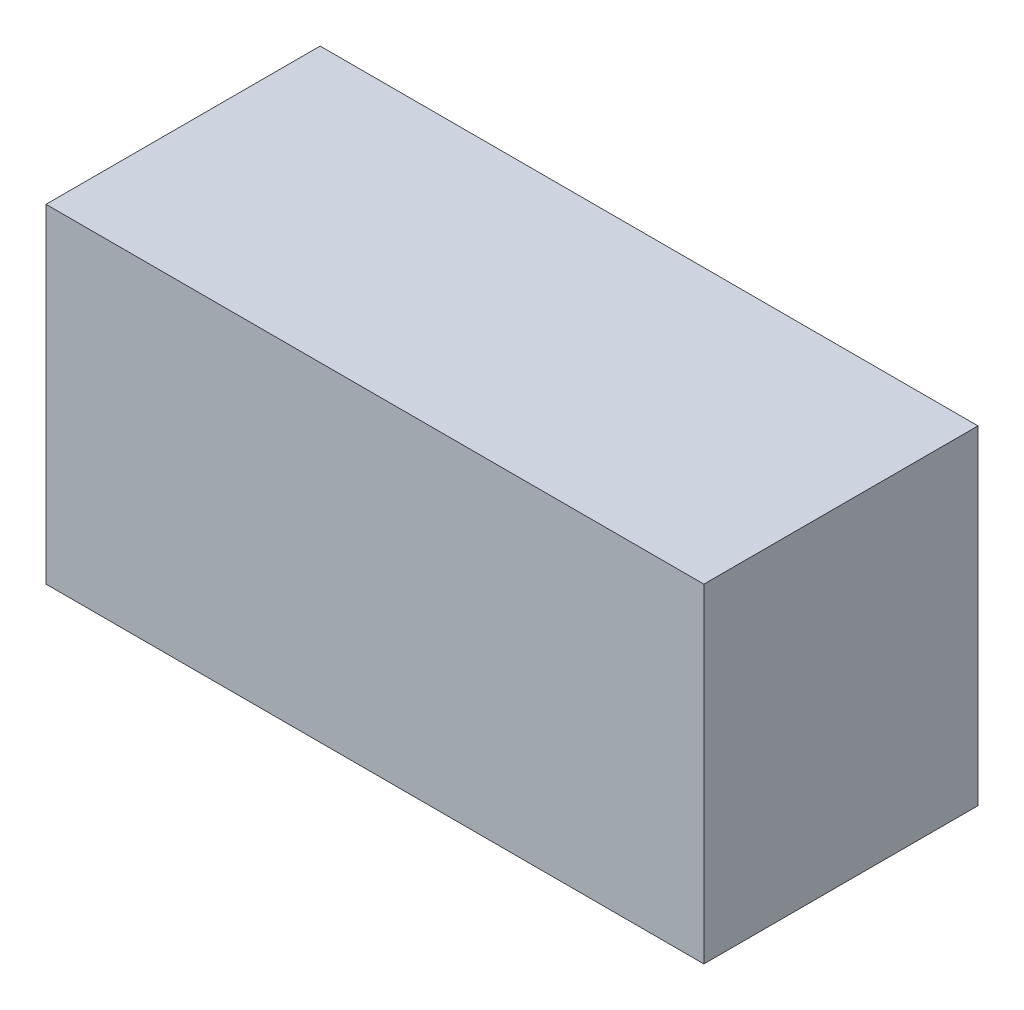
ISO-10303-21;
HEADER;
FILE_DESCRIPTION(('STEP AP214'),'2;1');
FILE_NAME('part.step','',(''),(''),'','','');
FILE_SCHEMA(('AUTOMOTIVE_DESIGN { 1 0 10303 214 1 1 1 1 }'));
ENDSEC;
DATA;
#1=APPLICATION_CONTEXT('core data for automotive mechanical design processes');
#2=APPLICATION_PROTOCOL_DEFINITION('international standard','automotive_design',2000,#1);
#3=PRODUCT_CONTEXT('',#1,'mechanical');
#4=PRODUCT('Part','Part','',(#3));
#5=PRODUCT_RELATED_PRODUCT_CATEGORY('part','',(#4));
#6=PRODUCT_DEFINITION_FORMATION('','',#4);
#7=PRODUCT_DEFINITION_CONTEXT('part definition',#1,'design');
#8=PRODUCT_DEFINITION('design','',#6,#7);
#9=PRODUCT_DEFINITION_SHAPE('','',#8);
#10=(LENGTH_UNIT() NAMED_UNIT(*) SI_UNIT(.MILLI.,.METRE.));
#11=(NAMED_UNIT(*) PLANE_ANGLE_UNIT() SI_UNIT($,.RADIAN.));
#12=(NAMED_UNIT(*) SI_UNIT($,.STERADIAN.) SOLID_ANGLE_UNIT());
#13=UNCERTAINTY_MEASURE_WITH_UNIT(LENGTH_MEASURE(1.E-05),#10,'distance_accuracy_value','');
#14=(GEOMETRIC_REPRESENTATION_CONTEXT(3) GLOBAL_UNCERTAINTY_ASSIGNED_CONTEXT((#13)) GLOBAL_UNIT_ASSIGNED_CONTEXT((#10,
#11,#12)) REPRESENTATION_CONTEXT('',''));
#15=CARTESIAN_POINT('',(0.,0.,0.));
#16=DIRECTION('',(0.,0.,1.));
#17=DIRECTION('',(1.,0.,0.));
#18=AXIS2_PLACEMENT_3D('',#15,#16,#17);
#19=CARTESIAN_POINT('',(300.,0.,0.));
#20=DIRECTION('',(0.,0.,-1.));
#21=DIRECTION('',(-1.,0.,0.));
#22=AXIS2_PLACEMENT_3D('',#19,#20,#21);
#23=PLANE('',#22);
#24=DIRECTION('',(0.,-1.,0.));
#25=VECTOR('',#24,1.);
#26=CARTESIAN_POINT('',(0.,0.,0.));
#27=LINE('',#26,#25);
#28=CARTESIAN_POINT('',(0.,150.,0.));
#29=VERTEX_POINT('',#28);
#30=CARTESIAN_POINT('',(0.,0.,0.));
#31=VERTEX_POINT('',#30);
#32=EDGE_CURVE('E101',#29,#31,#27,.T.);
#33=ORIENTED_EDGE('',*,*,#32,.T.);
#34=DIRECTION('',(-1.,0.,0.));
#35=VECTOR('',#34,1.);
#36=CARTESIAN_POINT('',(300.,0.,0.));
#37=LINE('',#36,#35);
#38=CARTESIAN_POINT('',(300.,0.,0.));
#39=VERTEX_POINT('',#38);
#40=EDGE_CURVE('E11',#39,#31,#37,.T.);
#41=ORIENTED_EDGE('',*,*,#40,.F.);
#42=DIRECTION('',(0.,-1.,0.));
#43=VECTOR('',#42,1.);
#44=CARTESIAN_POINT('',(300.,0.,0.));
#45=LINE('',#44,#43);
#46=CARTESIAN_POINT('',(300.,150.,0.));
#47=VERTEX_POINT('',#46);
#48=EDGE_CURVE('E89',#47,#39,#45,.T.);
#49=ORIENTED_EDGE('',*,*,#48,.F.);
#50=DIRECTION('',(-1.,0.,0.));
#51=VECTOR('',#50,1.);
#52=CARTESIAN_POINT('',(300.,150.,0.));
#53=LINE('',#52,#51);
#54=EDGE_CURVE('E97',#47,#29,#53,.T.);
#55=ORIENTED_EDGE('',*,*,#54,.T.);
#56=EDGE_LOOP('',(#33,#41,#49,#55));
#57=FACE_BOUND('',#56,.T.);
#58=ADVANCED_FACE('F38',(#57),#23,.F.);
#59=CARTESIAN_POINT('',(300.,0.,0.));
#60=DIRECTION('',(0.,1.,0.));
#61=DIRECTION('',(0.,0.,1.));
#62=AXIS2_PLACEMENT_3D('',#59,#60,#61);
#63=PLANE('',#62);
#64=DIRECTION('',(0.,0.,-1.));
#65=VECTOR('',#64,1.);
#66=CARTESIAN_POINT('',(0.,0.,0.));
#67=LINE('',#66,#65);
#68=CARTESIAN_POINT('',(0.,0.,-125.));
#69=VERTEX_POINT('',#68);
#70=EDGE_CURVE('E93',#31,#69,#67,.T.);
#71=ORIENTED_EDGE('',*,*,#70,.T.);
#72=DIRECTION('',(-1.,0.,0.));
#73=VECTOR('',#72,1.);
#74=CARTESIAN_POINT('',(300.,0.,-125.));
#75=LINE('',#74,#73);
#76=CARTESIAN_POINT('',(300.,0.,-125.));
#77=VERTEX_POINT('',#76);
#78=EDGE_CURVE('E46',#77,#69,#75,.T.);
#79=ORIENTED_EDGE('',*,*,#78,.F.);
#80=DIRECTION('',(0.,0.,-1.));
#81=VECTOR('',#80,1.);
#82=CARTESIAN_POINT('',(300.,0.,0.));
#83=LINE('',#82,#81);
#84=EDGE_CURVE('E84',#39,#77,#83,.T.);
#85=ORIENTED_EDGE('',*,*,#84,.F.);
#86=ORIENTED_EDGE('',*,*,#40,.T.);
#87=EDGE_LOOP('',(#71,#79,#85,#86));
#88=FACE_BOUND('',#87,.T.);
#89=ADVANCED_FACE('F92',(#88),#63,.F.);
#90=CARTESIAN_POINT('',(300.,0.,-125.));
#91=DIRECTION('',(0.,0.,1.));
#92=DIRECTION('',(1.,0.,0.));
#93=AXIS2_PLACEMENT_3D('',#90,#91,#92);
#94=PLANE('',#93);
#95=DIRECTION('',(0.,1.,0.));
#96=VECTOR('',#95,1.);
#97=CARTESIAN_POINT('',(0.,0.,-125.));
#98=LINE('',#97,#96);
#99=CARTESIAN_POINT('',(0.,150.,-125.));
#100=VERTEX_POINT('',#99);
#101=EDGE_CURVE('E71',#69,#100,#98,.T.);
#102=ORIENTED_EDGE('',*,*,#101,.T.);
#103=DIRECTION('',(-1.,0.,0.));
#104=VECTOR('',#103,1.);
#105=CARTESIAN_POINT('',(300.,150.,-125.));
#106=LINE('',#105,#104);
#107=CARTESIAN_POINT('',(300.,150.,-125.));
#108=VERTEX_POINT('',#107);
#109=EDGE_CURVE('E94',#108,#100,#106,.T.);
#110=ORIENTED_EDGE('',*,*,#109,.F.);
#111=DIRECTION('',(0.,1.,0.));
#112=VECTOR('',#111,1.);
#113=CARTESIAN_POINT('',(300.,0.,-125.));
#114=LINE('',#113,#112);
#115=EDGE_CURVE('E87',#77,#108,#114,.T.);
#116=ORIENTED_EDGE('',*,*,#115,.F.);
#117=ORIENTED_EDGE('',*,*,#78,.T.);
#118=EDGE_LOOP('',(#102,#110,#116,#117));
#119=FACE_BOUND('',#118,.T.);
#120=ADVANCED_FACE('F95',(#119),#94,.F.);
#121=CARTESIAN_POINT('',(300.,150.,0.));
#122=DIRECTION('',(0.,-1.,0.));
#123=DIRECTION('',(0.,0.,-1.));
#124=AXIS2_PLACEMENT_3D('',#121,#122,#123);
#125=PLANE('',#124);
#126=DIRECTION('',(0.,0.,1.));
#127=VECTOR('',#126,1.);
#128=CARTESIAN_POINT('',(0.,150.,0.));
#129=LINE('',#128,#127);
#130=EDGE_CURVE('E77',#100,#29,#129,.T.);
#131=ORIENTED_EDGE('',*,*,#130,.T.);
#132=ORIENTED_EDGE('',*,*,#54,.F.);
#133=DIRECTION('',(0.,0.,1.));
#134=VECTOR('',#133,1.);
#135=CARTESIAN_POINT('',(300.,150.,0.));
#136=LINE('',#135,#134);
#137=EDGE_CURVE('E54',#108,#47,#136,.T.);
#138=ORIENTED_EDGE('',*,*,#137,.F.);
#139=ORIENTED_EDGE('',*,*,#109,.T.);
#140=EDGE_LOOP('',(#131,#132,#138,#139));
#141=FACE_BOUND('',#140,.T.);
#142=ADVANCED_FACE('F108',(#141),#125,.F.);
#143=CARTESIAN_POINT('',(300.,0.,0.));
#144=DIRECTION('',(-1.,0.,0.));
#145=DIRECTION('',(0.,0.,1.));
#146=AXIS2_PLACEMENT_3D('',#143,#144,#145);
#147=PLANE('',#146);
#148=ORIENTED_EDGE('',*,*,#48,.T.);
#149=ORIENTED_EDGE('',*,*,#84,.T.);
#150=ORIENTED_EDGE('',*,*,#115,.T.);
#151=ORIENTED_EDGE('',*,*,#137,.T.);
#152=EDGE_LOOP('',(#148,#149,#150,#151));
#153=FACE_BOUND('',#152,.T.);
#154=ADVANCED_FACE('F85',(#153),#147,.F.);
#155=CARTESIAN_POINT('',(0.,0.,0.));
#156=DIRECTION('',(-1.,0.,0.));
#157=DIRECTION('',(0.,0.,1.));
#158=AXIS2_PLACEMENT_3D('',#155,#156,#157);
#159=PLANE('',#158);
#160=ORIENTED_EDGE('',*,*,#32,.F.);
#161=ORIENTED_EDGE('',*,*,#130,.F.);
#162=ORIENTED_EDGE('',*,*,#101,.F.);
#163=ORIENTED_EDGE('',*,*,#70,.F.);
#164=EDGE_LOOP('',(#160,#161,#162,#163));
#165=FACE_BOUND('',#164,.T.);
#166=ADVANCED_FACE('F111',(#165),#159,.T.);
#167=CLOSED_SHELL('',(#58,#89,#120,#142,#154,#166));
#168=MANIFOLD_SOLID_BREP('B2',#167);
#169=ADVANCED_BREP_SHAPE_REPRESENTATION('',(#18,#168),#14);
#170=SHAPE_DEFINITION_REPRESENTATION(#9,#169);
ENDSEC;
END-ISO-10303-21;
